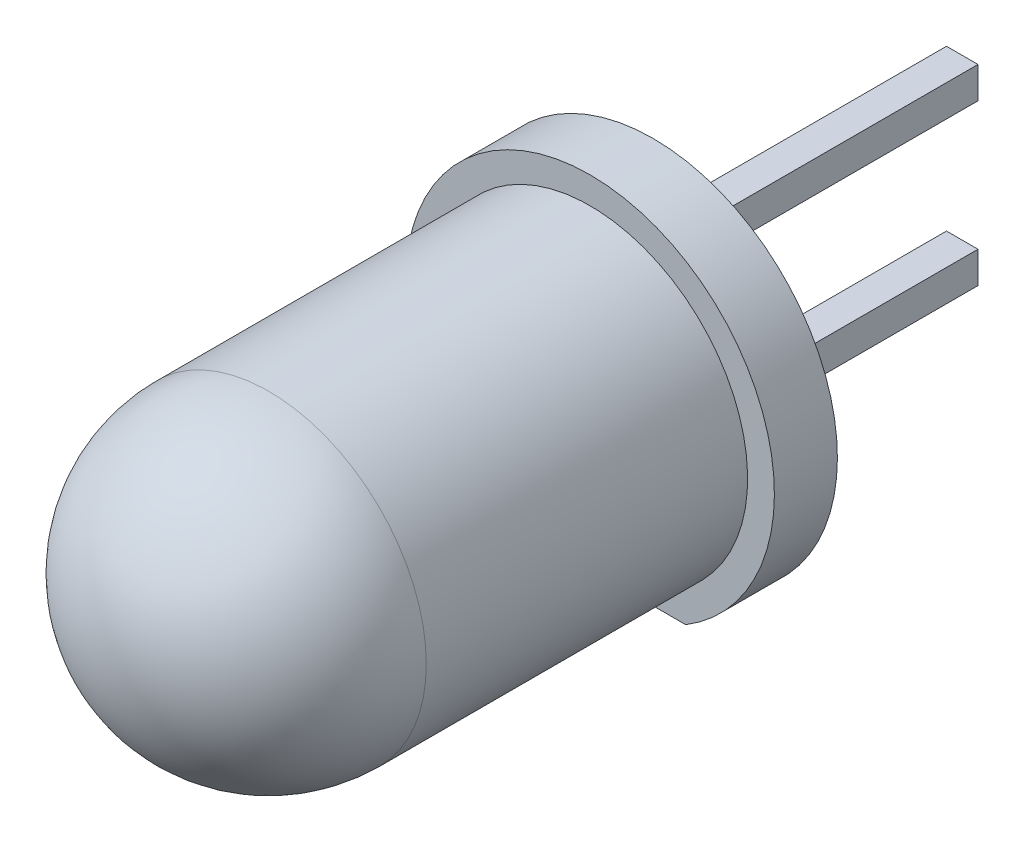
ISO-10303-21;
HEADER;
FILE_DESCRIPTION(('STEP AP214'),'2;1');
FILE_NAME('part.step','',(''),(''),'','','');
FILE_SCHEMA(('AUTOMOTIVE_DESIGN { 1 0 10303 214 1 1 1 1 }'));
ENDSEC;
DATA;
#1=APPLICATION_CONTEXT('core data for automotive mechanical design processes');
#2=APPLICATION_PROTOCOL_DEFINITION('international standard','automotive_design',2000,#1);
#3=PRODUCT_CONTEXT('',#1,'mechanical');
#4=PRODUCT('Part','Part','',(#3));
#5=PRODUCT_RELATED_PRODUCT_CATEGORY('part','',(#4));
#6=PRODUCT_DEFINITION_FORMATION('','',#4);
#7=PRODUCT_DEFINITION_CONTEXT('part definition',#1,'design');
#8=PRODUCT_DEFINITION('design','',#6,#7);
#9=PRODUCT_DEFINITION_SHAPE('','',#8);
#10=(LENGTH_UNIT() NAMED_UNIT(*) SI_UNIT(.MILLI.,.METRE.));
#11=(NAMED_UNIT(*) PLANE_ANGLE_UNIT() SI_UNIT($,.RADIAN.));
#12=(NAMED_UNIT(*) SI_UNIT($,.STERADIAN.) SOLID_ANGLE_UNIT());
#13=UNCERTAINTY_MEASURE_WITH_UNIT(LENGTH_MEASURE(1.E-05),#10,'distance_accuracy_value','');
#14=(GEOMETRIC_REPRESENTATION_CONTEXT(3) GLOBAL_UNCERTAINTY_ASSIGNED_CONTEXT((#13)) GLOBAL_UNIT_ASSIGNED_CONTEXT((#10,
#11,#12)) REPRESENTATION_CONTEXT('',''));
#15=CARTESIAN_POINT('',(0.,0.,0.));
#16=DIRECTION('',(0.,0.,1.));
#17=DIRECTION('',(1.,0.,0.));
#18=AXIS2_PLACEMENT_3D('',#15,#16,#17);
#19=CARTESIAN_POINT('',(0.,0.,-1.));
#20=DIRECTION('',(0.,0.,-1.));
#21=DIRECTION('',(-1.,0.,0.));
#22=AXIS2_PLACEMENT_3D('',#19,#20,#21);
#23=PLANE('',#22);
#24=DIRECTION('',(1.,0.,0.));
#25=VECTOR('',#24,1.);
#26=CARTESIAN_POINT('',(0.,-2.5,-1.));
#27=LINE('',#26,#25);
#28=CARTESIAN_POINT('',(-1.51842846390602,-2.5,-1.));
#29=VERTEX_POINT('',#28);
#30=CARTESIAN_POINT('',(1.51842846390602,-2.5,-1.));
#31=VERTEX_POINT('',#30);
#32=EDGE_CURVE('E215',#29,#31,#27,.T.);
#33=ORIENTED_EDGE('',*,*,#32,.F.);
#34=CARTESIAN_POINT('',(0.,0.,-1.));
#35=DIRECTION('',(0.,0.,-1.));
#36=DIRECTION('',(-1.,0.,0.));
#37=AXIS2_PLACEMENT_3D('',#34,#35,#36);
#38=CIRCLE('',#37,2.925);
#39=EDGE_CURVE('E214',#29,#31,#38,.T.);
#40=ORIENTED_EDGE('',*,*,#39,.T.);
#41=EDGE_LOOP('',(#33,#40));
#42=FACE_BOUND('',#41,.T.);
#43=DIRECTION('',(-1.,0.,0.));
#44=VECTOR('',#43,1.);
#45=CARTESIAN_POINT('',(-0.343693204923737,1.02,-1.));
#46=LINE('',#45,#44);
#47=CARTESIAN_POINT('',(0.156306795076263,1.02,-1.));
#48=VERTEX_POINT('',#47);
#49=CARTESIAN_POINT('',(-0.343693204923737,1.02,-1.));
#50=VERTEX_POINT('',#49);
#51=EDGE_CURVE('E757',#48,#50,#46,.T.);
#52=ORIENTED_EDGE('',*,*,#51,.F.);
#53=DIRECTION('',(0.,-1.,0.));
#54=VECTOR('',#53,1.);
#55=CARTESIAN_POINT('',(0.156306795076263,1.02,-1.));
#56=LINE('',#55,#54);
#57=CARTESIAN_POINT('',(0.156306795076263,1.52,-1.));
#58=VERTEX_POINT('',#57);
#59=EDGE_CURVE('E753',#58,#48,#56,.T.);
#60=ORIENTED_EDGE('',*,*,#59,.F.);
#61=DIRECTION('',(1.,0.,0.));
#62=VECTOR('',#61,1.);
#63=CARTESIAN_POINT('',(-0.343693204923737,1.52,-1.));
#64=LINE('',#63,#62);
#65=CARTESIAN_POINT('',(-0.343693204923737,1.52,-1.));
#66=VERTEX_POINT('',#65);
#67=EDGE_CURVE('E767',#66,#58,#64,.T.);
#68=ORIENTED_EDGE('',*,*,#67,.F.);
#69=DIRECTION('',(0.,1.,0.));
#70=VECTOR('',#69,1.);
#71=CARTESIAN_POINT('',(-0.343693204923737,1.02,-1.));
#72=LINE('',#71,#70);
#73=EDGE_CURVE('E775',#50,#66,#72,.T.);
#74=ORIENTED_EDGE('',*,*,#73,.F.);
#75=EDGE_LOOP('',(#52,#60,#68,#74));
#76=FACE_BOUND('',#75,.T.);
#77=DIRECTION('',(0.,-1.,0.));
#78=VECTOR('',#77,1.);
#79=CARTESIAN_POINT('',(0.156306795076263,-1.02,-1.));
#80=LINE('',#79,#78);
#81=CARTESIAN_POINT('',(0.156306795076263,-1.02,-1.));
#82=VERTEX_POINT('',#81);
#83=CARTESIAN_POINT('',(0.156306795076263,-1.52,-1.));
#84=VERTEX_POINT('',#83);
#85=EDGE_CURVE('E817',#82,#84,#80,.T.);
#86=ORIENTED_EDGE('',*,*,#85,.F.);
#87=DIRECTION('',(1.,0.,0.));
#88=VECTOR('',#87,1.);
#89=CARTESIAN_POINT('',(-0.343693204923737,-1.02,-1.));
#90=LINE('',#89,#88);
#91=CARTESIAN_POINT('',(-0.343693204923737,-1.02,-1.));
#92=VERTEX_POINT('',#91);
#93=EDGE_CURVE('E751',#92,#82,#90,.T.);
#94=ORIENTED_EDGE('',*,*,#93,.F.);
#95=DIRECTION('',(0.,1.,0.));
#96=VECTOR('',#95,1.);
#97=CARTESIAN_POINT('',(-0.343693204923737,-1.02,-1.));
#98=LINE('',#97,#96);
#99=CARTESIAN_POINT('',(-0.343693204923737,-1.52,-1.));
#100=VERTEX_POINT('',#99);
#101=EDGE_CURVE('E746',#100,#92,#98,.T.);
#102=ORIENTED_EDGE('',*,*,#101,.F.);
#103=DIRECTION('',(-1.,0.,0.));
#104=VECTOR('',#103,1.);
#105=CARTESIAN_POINT('',(-0.343693204923737,-1.52,-1.));
#106=LINE('',#105,#104);
#107=EDGE_CURVE('E819',#84,#100,#106,.T.);
#108=ORIENTED_EDGE('',*,*,#107,.F.);
#109=EDGE_LOOP('',(#86,#94,#102,#108));
#110=FACE_BOUND('',#109,.T.);
#111=ADVANCED_FACE('F37',(#42,#76,#110),#23,.T.);
#112=CARTESIAN_POINT('',(0.,0.,5.1));
#113=DIRECTION('',(0.,0.,-1.));
#114=DIRECTION('',(-1.,0.,0.));
#115=AXIS2_PLACEMENT_3D('',#112,#113,#114);
#116=CYLINDRICAL_SURFACE('',#115,2.5);
#117=CARTESIAN_POINT('',(0.,0.,5.1));
#118=DIRECTION('',(0.,0.,1.));
#119=DIRECTION('',(1.,0.,0.));
#120=AXIS2_PLACEMENT_3D('',#117,#118,#119);
#121=CIRCLE('',#120,2.5);
#122=CARTESIAN_POINT('',(2.5,0.,5.1));
#123=VERTEX_POINT('',#122);
#124=EDGE_CURVE('E46',#123,#123,#121,.T.);
#125=ORIENTED_EDGE('',*,*,#124,.F.);
#126=EDGE_LOOP('',(#125));
#127=FACE_BOUND('',#126,.T.);
#128=CARTESIAN_POINT('',(0.,0.,0.));
#129=DIRECTION('',(0.,0.,-1.));
#130=DIRECTION('',(-1.,0.,0.));
#131=AXIS2_PLACEMENT_3D('',#128,#129,#130);
#132=CIRCLE('',#131,2.5);
#133=CARTESIAN_POINT('',(0.,-2.5,0.));
#134=VERTEX_POINT('',#133);
#135=EDGE_CURVE('E220',#134,#134,#132,.T.);
#136=ORIENTED_EDGE('',*,*,#135,.F.);
#137=EDGE_LOOP('',(#136));
#138=FACE_BOUND('',#137,.T.);
#139=ADVANCED_FACE('F39',(#127,#138),#116,.T.);
#140=CARTESIAN_POINT('',(0.,0.,5.1));
#141=DIRECTION('',(-1.,0.,0.));
#142=DIRECTION('',(0.,-1.,0.));
#143=AXIS2_PLACEMENT_3D('',#140,#141,#142);
#144=SPHERICAL_SURFACE('',#143,2.5);
#145=CARTESIAN_POINT('',(0.,0.,5.1));
#146=DIRECTION('',(0.,0.,1.));
#147=DIRECTION('',(1.,0.,0.));
#148=AXIS2_PLACEMENT_3D('',#145,#146,#147);
#149=SPHERICAL_SURFACE('',#148,2.5);
#150=ORIENTED_EDGE('',*,*,#124,.T.);
#151=EDGE_LOOP('',(#150));
#152=FACE_BOUND('',#151,.T.);
#153=ADVANCED_FACE('F235',(#152),#149,.T.);
#154=CARTESIAN_POINT('',(0.,0.,-1.));
#155=DIRECTION('',(0.,0.,1.));
#156=DIRECTION('',(1.,0.,0.));
#157=AXIS2_PLACEMENT_3D('',#154,#155,#156);
#158=CYLINDRICAL_SURFACE('',#157,2.925);
#159=ORIENTED_EDGE('',*,*,#39,.F.);
#160=DIRECTION('',(0.,0.,1.));
#161=VECTOR('',#160,1.);
#162=CARTESIAN_POINT('',(-1.51842846390602,-2.5,-5.));
#163=LINE('',#162,#161);
#164=CARTESIAN_POINT('',(-1.51842846390602,-2.5,0.));
#165=VERTEX_POINT('',#164);
#166=EDGE_CURVE('E202',#29,#165,#163,.T.);
#167=ORIENTED_EDGE('',*,*,#166,.T.);
#168=CARTESIAN_POINT('',(0.,0.,0.));
#169=DIRECTION('',(0.,0.,-1.));
#170=DIRECTION('',(-1.,0.,0.));
#171=AXIS2_PLACEMENT_3D('',#168,#169,#170);
#172=CIRCLE('',#171,2.925);
#173=CARTESIAN_POINT('',(1.51842846390602,-2.5,0.));
#174=VERTEX_POINT('',#173);
#175=EDGE_CURVE('E212',#165,#174,#172,.T.);
#176=ORIENTED_EDGE('',*,*,#175,.T.);
#177=DIRECTION('',(0.,0.,1.));
#178=VECTOR('',#177,1.);
#179=CARTESIAN_POINT('',(1.51842846390602,-2.5,-5.));
#180=LINE('',#179,#178);
#181=EDGE_CURVE('E53',#31,#174,#180,.T.);
#182=ORIENTED_EDGE('',*,*,#181,.F.);
#183=EDGE_LOOP('',(#159,#167,#176,#182));
#184=FACE_BOUND('',#183,.T.);
#185=ADVANCED_FACE('F211',(#184),#158,.T.);
#186=CARTESIAN_POINT('',(0.,0.,0.));
#187=DIRECTION('',(0.,0.,-1.));
#188=DIRECTION('',(-1.,0.,0.));
#189=AXIS2_PLACEMENT_3D('',#186,#187,#188);
#190=PLANE('',#189);
#191=ORIENTED_EDGE('',*,*,#175,.F.);
#192=DIRECTION('',(1.,0.,0.));
#193=VECTOR('',#192,1.);
#194=CARTESIAN_POINT('',(0.,-2.5,0.));
#195=LINE('',#194,#193);
#196=EDGE_CURVE('E11',#165,#134,#195,.T.);
#197=ORIENTED_EDGE('',*,*,#196,.T.);
#198=ORIENTED_EDGE('',*,*,#135,.T.);
#199=DIRECTION('',(-1.,0.,0.));
#200=VECTOR('',#199,1.);
#201=CARTESIAN_POINT('',(1.51842846390602,-2.5,0.));
#202=LINE('',#201,#200);
#203=EDGE_CURVE('E204',#174,#134,#202,.T.);
#204=ORIENTED_EDGE('',*,*,#203,.F.);
#205=EDGE_LOOP('',(#191,#197,#198,#204));
#206=FACE_BOUND('',#205,.T.);
#207=ADVANCED_FACE('F217',(#206),#190,.F.);
#208=CARTESIAN_POINT('',(0.156306795076263,1.02,-6.));
#209=DIRECTION('',(-1.,0.,0.));
#210=DIRECTION('',(0.,0.,1.));
#211=AXIS2_PLACEMENT_3D('',#208,#209,#210);
#212=PLANE('',#211);
#213=ORIENTED_EDGE('',*,*,#59,.T.);
#214=DIRECTION('',(0.,0.,1.));
#215=VECTOR('',#214,1.);
#216=CARTESIAN_POINT('',(0.156306795076263,1.02,-6.));
#217=LINE('',#216,#215);
#218=CARTESIAN_POINT('',(0.156306795076263,1.02,-6.));
#219=VERTEX_POINT('',#218);
#220=EDGE_CURVE('E314',#219,#48,#217,.T.);
#221=ORIENTED_EDGE('',*,*,#220,.F.);
#222=DIRECTION('',(0.,-1.,0.));
#223=VECTOR('',#222,1.);
#224=CARTESIAN_POINT('',(0.156306795076263,1.02,-6.));
#225=LINE('',#224,#223);
#226=CARTESIAN_POINT('',(0.156306795076263,1.52,-6.));
#227=VERTEX_POINT('',#226);
#228=EDGE_CURVE('E763',#227,#219,#225,.T.);
#229=ORIENTED_EDGE('',*,*,#228,.F.);
#230=DIRECTION('',(0.,0.,1.));
#231=VECTOR('',#230,1.);
#232=CARTESIAN_POINT('',(0.156306795076263,1.52,-6.));
#233=LINE('',#232,#231);
#234=EDGE_CURVE('E772',#227,#58,#233,.T.);
#235=ORIENTED_EDGE('',*,*,#234,.T.);
#236=EDGE_LOOP('',(#213,#221,#229,#235));
#237=FACE_BOUND('',#236,.T.);
#238=ADVANCED_FACE('F256',(#237),#212,.F.);
#239=CARTESIAN_POINT('',(-0.343693204923737,1.02,-6.));
#240=DIRECTION('',(0.,1.,0.));
#241=DIRECTION('',(0.,0.,1.));
#242=AXIS2_PLACEMENT_3D('',#239,#240,#241);
#243=PLANE('',#242);
#244=ORIENTED_EDGE('',*,*,#51,.T.);
#245=DIRECTION('',(0.,0.,1.));
#246=VECTOR('',#245,1.);
#247=CARTESIAN_POINT('',(-0.343693204923737,1.02,-6.));
#248=LINE('',#247,#246);
#249=CARTESIAN_POINT('',(-0.343693204923737,1.02,-6.));
#250=VERTEX_POINT('',#249);
#251=EDGE_CURVE('E783',#250,#50,#248,.T.);
#252=ORIENTED_EDGE('',*,*,#251,.F.);
#253=DIRECTION('',(-1.,0.,0.));
#254=VECTOR('',#253,1.);
#255=CARTESIAN_POINT('',(-0.343693204923737,1.02,-6.));
#256=LINE('',#255,#254);
#257=EDGE_CURVE('E766',#219,#250,#256,.T.);
#258=ORIENTED_EDGE('',*,*,#257,.F.);
#259=ORIENTED_EDGE('',*,*,#220,.T.);
#260=EDGE_LOOP('',(#244,#252,#258,#259));
#261=FACE_BOUND('',#260,.T.);
#262=ADVANCED_FACE('F553',(#261),#243,.F.);
#263=CARTESIAN_POINT('',(-0.343693204923737,1.02,-6.));
#264=DIRECTION('',(1.,0.,0.));
#265=DIRECTION('',(0.,0.,-1.));
#266=AXIS2_PLACEMENT_3D('',#263,#264,#265);
#267=PLANE('',#266);
#268=ORIENTED_EDGE('',*,*,#73,.T.);
#269=DIRECTION('',(0.,0.,1.));
#270=VECTOR('',#269,1.);
#271=CARTESIAN_POINT('',(-0.343693204923737,1.52,-6.));
#272=LINE('',#271,#270);
#273=CARTESIAN_POINT('',(-0.343693204923737,1.52,-6.));
#274=VERTEX_POINT('',#273);
#275=EDGE_CURVE('E781',#274,#66,#272,.T.);
#276=ORIENTED_EDGE('',*,*,#275,.F.);
#277=DIRECTION('',(0.,1.,0.));
#278=VECTOR('',#277,1.);
#279=CARTESIAN_POINT('',(-0.343693204923737,1.02,-6.));
#280=LINE('',#279,#278);
#281=EDGE_CURVE('E769',#250,#274,#280,.T.);
#282=ORIENTED_EDGE('',*,*,#281,.F.);
#283=ORIENTED_EDGE('',*,*,#251,.T.);
#284=EDGE_LOOP('',(#268,#276,#282,#283));
#285=FACE_BOUND('',#284,.T.);
#286=ADVANCED_FACE('F566',(#285),#267,.F.);
#287=CARTESIAN_POINT('',(-0.343693204923737,1.52,-6.));
#288=DIRECTION('',(0.,-1.,0.));
#289=DIRECTION('',(0.,0.,-1.));
#290=AXIS2_PLACEMENT_3D('',#287,#288,#289);
#291=PLANE('',#290);
#292=ORIENTED_EDGE('',*,*,#67,.T.);
#293=ORIENTED_EDGE('',*,*,#234,.F.);
#294=DIRECTION('',(1.,0.,0.));
#295=VECTOR('',#294,1.);
#296=CARTESIAN_POINT('',(-0.343693204923737,1.52,-6.));
#297=LINE('',#296,#295);
#298=EDGE_CURVE('E771',#274,#227,#297,.T.);
#299=ORIENTED_EDGE('',*,*,#298,.F.);
#300=ORIENTED_EDGE('',*,*,#275,.T.);
#301=EDGE_LOOP('',(#292,#293,#299,#300));
#302=FACE_BOUND('',#301,.T.);
#303=ADVANCED_FACE('F579',(#302),#291,.F.);
#304=CARTESIAN_POINT('',(0.,0.,-6.));
#305=DIRECTION('',(0.,0.,-1.));
#306=DIRECTION('',(-1.,0.,0.));
#307=AXIS2_PLACEMENT_3D('',#304,#305,#306);
#308=PLANE('',#307);
#309=ORIENTED_EDGE('',*,*,#228,.T.);
#310=ORIENTED_EDGE('',*,*,#257,.T.);
#311=ORIENTED_EDGE('',*,*,#281,.T.);
#312=ORIENTED_EDGE('',*,*,#298,.T.);
#313=EDGE_LOOP('',(#309,#310,#311,#312));
#314=FACE_BOUND('',#313,.T.);
#315=ADVANCED_FACE('F590',(#314),#308,.T.);
#316=CARTESIAN_POINT('',(-0.343693204923737,-1.02,-6.));
#317=DIRECTION('',(0.,-1.,0.));
#318=DIRECTION('',(0.,0.,-1.));
#319=AXIS2_PLACEMENT_3D('',#316,#317,#318);
#320=PLANE('',#319);
#321=ORIENTED_EDGE('',*,*,#93,.T.);
#322=DIRECTION('',(0.,0.,1.));
#323=VECTOR('',#322,1.);
#324=CARTESIAN_POINT('',(0.156306795076263,-1.02,-6.));
#325=LINE('',#324,#323);
#326=CARTESIAN_POINT('',(0.156306795076263,-1.02,-6.));
#327=VERTEX_POINT('',#326);
#328=EDGE_CURVE('E749',#327,#82,#325,.T.);
#329=ORIENTED_EDGE('',*,*,#328,.F.);
#330=DIRECTION('',(1.,0.,0.));
#331=VECTOR('',#330,1.);
#332=CARTESIAN_POINT('',(-0.343693204923737,-1.02,-6.));
#333=LINE('',#332,#331);
#334=CARTESIAN_POINT('',(-0.343693204923737,-1.02,-6.));
#335=VERTEX_POINT('',#334);
#336=EDGE_CURVE('E739',#335,#327,#333,.T.);
#337=ORIENTED_EDGE('',*,*,#336,.F.);
#338=DIRECTION('',(0.,0.,1.));
#339=VECTOR('',#338,1.);
#340=CARTESIAN_POINT('',(-0.343693204923737,-1.02,-6.));
#341=LINE('',#340,#339);
#342=EDGE_CURVE('E826',#335,#92,#341,.T.);
#343=ORIENTED_EDGE('',*,*,#342,.T.);
#344=EDGE_LOOP('',(#321,#329,#337,#343));
#345=FACE_BOUND('',#344,.T.);
#346=ADVANCED_FACE('F602',(#345),#320,.F.);
#347=CARTESIAN_POINT('',(0.156306795076263,-1.02,-6.));
#348=DIRECTION('',(-1.,0.,0.));
#349=DIRECTION('',(0.,0.,1.));
#350=AXIS2_PLACEMENT_3D('',#347,#348,#349);
#351=PLANE('',#350);
#352=ORIENTED_EDGE('',*,*,#85,.T.);
#353=DIRECTION('',(0.,0.,1.));
#354=VECTOR('',#353,1.);
#355=CARTESIAN_POINT('',(0.156306795076263,-1.52,-6.));
#356=LINE('',#355,#354);
#357=CARTESIAN_POINT('',(0.156306795076263,-1.52,-6.));
#358=VERTEX_POINT('',#357);
#359=EDGE_CURVE('E754',#358,#84,#356,.T.);
#360=ORIENTED_EDGE('',*,*,#359,.F.);
#361=DIRECTION('',(0.,-1.,0.));
#362=VECTOR('',#361,1.);
#363=CARTESIAN_POINT('',(0.156306795076263,-1.02,-6.));
#364=LINE('',#363,#362);
#365=EDGE_CURVE('E741',#327,#358,#364,.T.);
#366=ORIENTED_EDGE('',*,*,#365,.F.);
#367=ORIENTED_EDGE('',*,*,#328,.T.);
#368=EDGE_LOOP('',(#352,#360,#366,#367));
#369=FACE_BOUND('',#368,.T.);
#370=ADVANCED_FACE('F613',(#369),#351,.F.);
#371=CARTESIAN_POINT('',(-0.343693204923737,-1.52,-6.));
#372=DIRECTION('',(0.,1.,0.));
#373=DIRECTION('',(0.,0.,1.));
#374=AXIS2_PLACEMENT_3D('',#371,#372,#373);
#375=PLANE('',#374);
#376=ORIENTED_EDGE('',*,*,#107,.T.);
#377=DIRECTION('',(0.,0.,1.));
#378=VECTOR('',#377,1.);
#379=CARTESIAN_POINT('',(-0.343693204923737,-1.52,-6.));
#380=LINE('',#379,#378);
#381=CARTESIAN_POINT('',(-0.343693204923737,-1.52,-6.));
#382=VERTEX_POINT('',#381);
#383=EDGE_CURVE('E61',#382,#100,#380,.T.);
#384=ORIENTED_EDGE('',*,*,#383,.F.);
#385=DIRECTION('',(-1.,0.,0.));
#386=VECTOR('',#385,1.);
#387=CARTESIAN_POINT('',(-0.343693204923737,-1.52,-6.));
#388=LINE('',#387,#386);
#389=EDGE_CURVE('E827',#358,#382,#388,.T.);
#390=ORIENTED_EDGE('',*,*,#389,.F.);
#391=ORIENTED_EDGE('',*,*,#359,.T.);
#392=EDGE_LOOP('',(#376,#384,#390,#391));
#393=FACE_BOUND('',#392,.T.);
#394=ADVANCED_FACE('F623',(#393),#375,.F.);
#395=CARTESIAN_POINT('',(-0.343693204923737,-1.02,-6.));
#396=DIRECTION('',(1.,0.,0.));
#397=DIRECTION('',(0.,0.,-1.));
#398=AXIS2_PLACEMENT_3D('',#395,#396,#397);
#399=PLANE('',#398);
#400=ORIENTED_EDGE('',*,*,#101,.T.);
#401=ORIENTED_EDGE('',*,*,#342,.F.);
#402=DIRECTION('',(0.,1.,0.));
#403=VECTOR('',#402,1.);
#404=CARTESIAN_POINT('',(-0.343693204923737,-1.02,-6.));
#405=LINE('',#404,#403);
#406=EDGE_CURVE('E743',#382,#335,#405,.T.);
#407=ORIENTED_EDGE('',*,*,#406,.F.);
#408=ORIENTED_EDGE('',*,*,#383,.T.);
#409=EDGE_LOOP('',(#400,#401,#407,#408));
#410=FACE_BOUND('',#409,.T.);
#411=ADVANCED_FACE('F634',(#410),#399,.F.);
#412=CARTESIAN_POINT('',(0.,0.,-6.));
#413=DIRECTION('',(0.,0.,-1.));
#414=DIRECTION('',(-1.,0.,0.));
#415=AXIS2_PLACEMENT_3D('',#412,#413,#414);
#416=PLANE('',#415);
#417=ORIENTED_EDGE('',*,*,#336,.T.);
#418=ORIENTED_EDGE('',*,*,#365,.T.);
#419=ORIENTED_EDGE('',*,*,#389,.T.);
#420=ORIENTED_EDGE('',*,*,#406,.T.);
#421=EDGE_LOOP('',(#417,#418,#419,#420));
#422=FACE_BOUND('',#421,.T.);
#423=ADVANCED_FACE('F644',(#422),#416,.T.);
#424=CARTESIAN_POINT('',(1.51842846390602,-2.5,-5.));
#425=DIRECTION('',(0.,1.,0.));
#426=DIRECTION('',(0.,0.,1.));
#427=AXIS2_PLACEMENT_3D('',#424,#425,#426);
#428=PLANE('',#427);
#429=ORIENTED_EDGE('',*,*,#32,.T.);
#430=ORIENTED_EDGE('',*,*,#181,.T.);
#431=ORIENTED_EDGE('',*,*,#203,.T.);
#432=ORIENTED_EDGE('',*,*,#196,.F.);
#433=ORIENTED_EDGE('',*,*,#166,.F.);
#434=EDGE_LOOP('',(#429,#430,#431,#432,#433));
#435=FACE_BOUND('',#434,.T.);
#436=ADVANCED_FACE('F201',(#435),#428,.F.);
#437=CLOSED_SHELL('',(#111,#139,#153,#185,#207,#238,#262,#286,#303,#315,#346,#370,#394,#411,
#423,#436));
#438=CARTESIAN_POINT('',(0.,0.,0.));
#439=DIRECTION('',(0.,0.,1.));
#440=DIRECTION('',(1.,0.,0.));
#441=AXIS2_PLACEMENT_3D('',#438,#439,#440);
#442=CIRCLE('',#441,2.);
#443=CARTESIAN_POINT('',(2.,0.,0.));
#444=VERTEX_POINT('',#443);
#445=EDGE_CURVE('E230',#444,#444,#442,.T.);
#446=ORIENTED_EDGE('',*,*,#445,.T.);
#447=EDGE_LOOP('',(#446));
#448=FACE_BOUND('',#447,.T.);
#449=DIRECTION('',(-1.,0.,0.));
#450=VECTOR('',#449,1.);
#451=CARTESIAN_POINT('',(0.25,1.07270159090425,0.));
#452=LINE('',#451,#450);
#453=CARTESIAN_POINT('',(0.25,1.07270159090425,0.));
#454=VERTEX_POINT('',#453);
#455=CARTESIAN_POINT('',(-0.25,1.07270159090425,0.));
#456=VERTEX_POINT('',#455);
#457=EDGE_CURVE('E218',#454,#456,#452,.T.);
#458=ORIENTED_EDGE('',*,*,#457,.F.);
#459=DIRECTION('',(0.,1.,0.));
#460=VECTOR('',#459,1.);
#461=CARTESIAN_POINT('',(0.25,1.07270159090425,0.));
#462=LINE('',#461,#460);
#463=CARTESIAN_POINT('',(0.25,0.763620954542548,0.));
#464=VERTEX_POINT('',#463);
#465=EDGE_CURVE('E348',#464,#454,#462,.T.);
#466=ORIENTED_EDGE('',*,*,#465,.F.);
#467=DIRECTION('',(-1.,0.,0.));
#468=VECTOR('',#467,1.);
#469=CARTESIAN_POINT('',(0.25,0.763620954542548,0.));
#470=LINE('',#469,#468);
#471=CARTESIAN_POINT('',(-0.25,0.763620954542548,0.));
#472=VERTEX_POINT('',#471);
#473=EDGE_CURVE('E363',#464,#472,#470,.T.);
#474=ORIENTED_EDGE('',*,*,#473,.T.);
#475=DIRECTION('',(0.,1.,0.));
#476=VECTOR('',#475,1.);
#477=CARTESIAN_POINT('',(-0.25,1.07270159090425,0.));
#478=LINE('',#477,#476);
#479=EDGE_CURVE('E347',#472,#456,#478,.T.);
#480=ORIENTED_EDGE('',*,*,#479,.T.);
#481=EDGE_LOOP('',(#458,#466,#474,#480));
#482=FACE_BOUND('',#481,.T.);
#483=DIRECTION('',(0.,1.,0.));
#484=VECTOR('',#483,1.);
#485=CARTESIAN_POINT('',(0.25,-0.417508620125371,0.));
#486=LINE('',#485,#484);
#487=CARTESIAN_POINT('',(0.25,-0.914245357135243,0.));
#488=VERTEX_POINT('',#487);
#489=CARTESIAN_POINT('',(0.25,-0.417508620125371,0.));
#490=VERTEX_POINT('',#489);
#491=EDGE_CURVE('E285',#488,#490,#486,.T.);
#492=ORIENTED_EDGE('',*,*,#491,.F.);
#493=DIRECTION('',(-1.,0.,0.));
#494=VECTOR('',#493,1.);
#495=CARTESIAN_POINT('',(0.25,-0.914245357135243,0.));
#496=LINE('',#495,#494);
#497=CARTESIAN_POINT('',(-0.25,-0.914245357135243,0.));
#498=VERTEX_POINT('',#497);
#499=EDGE_CURVE('E288',#488,#498,#496,.T.);
#500=ORIENTED_EDGE('',*,*,#499,.T.);
#501=DIRECTION('',(0.,1.,0.));
#502=VECTOR('',#501,1.);
#503=CARTESIAN_POINT('',(-0.25,-0.417508620125371,0.));
#504=LINE('',#503,#502);
#505=CARTESIAN_POINT('',(-0.25,-0.417508620125371,0.));
#506=VERTEX_POINT('',#505);
#507=EDGE_CURVE('E316',#498,#506,#504,.T.);
#508=ORIENTED_EDGE('',*,*,#507,.T.);
#509=DIRECTION('',(-1.,0.,0.));
#510=VECTOR('',#509,1.);
#511=CARTESIAN_POINT('',(0.25,-0.417508620125371,0.));
#512=LINE('',#511,#510);
#513=EDGE_CURVE('E290',#490,#506,#512,.T.);
#514=ORIENTED_EDGE('',*,*,#513,.F.);
#515=EDGE_LOOP('',(#492,#500,#508,#514));
#516=FACE_BOUND('',#515,.T.);
#517=ADVANCED_FACE('F257',(#448,#482,#516),#190,.F.);
#518=CARTESIAN_POINT('',(0.,0.,5.1));
#519=DIRECTION('',(-1.,0.,0.));
#520=DIRECTION('',(0.,1.,0.));
#521=AXIS2_PLACEMENT_3D('',#518,#519,#520);
#522=SPHERICAL_SURFACE('',#521,2.);
#523=CARTESIAN_POINT('',(0.,0.,5.1));
#524=DIRECTION('',(0.,0.,1.));
#525=DIRECTION('',(-1.,0.,0.));
#526=AXIS2_PLACEMENT_3D('',#523,#524,#525);
#527=SPHERICAL_SURFACE('',#526,2.);
#528=CARTESIAN_POINT('',(0.,0.,5.1));
#529=DIRECTION('',(0.,0.,1.));
#530=DIRECTION('',(-1.,0.,0.));
#531=AXIS2_PLACEMENT_3D('',#528,#529,#530);
#532=CIRCLE('',#531,2.);
#533=CARTESIAN_POINT('',(-2.,0.,5.1));
#534=VERTEX_POINT('',#533);
#535=EDGE_CURVE('E227',#534,#534,#532,.T.);
#536=ORIENTED_EDGE('',*,*,#535,.F.);
#537=EDGE_LOOP('',(#536));
#538=FACE_BOUND('',#537,.T.);
#539=ADVANCED_FACE('F260',(#538),#527,.F.);
#540=CARTESIAN_POINT('',(0.,0.,5.1));
#541=DIRECTION('',(0.,0.,-1.));
#542=DIRECTION('',(-1.,0.,0.));
#543=AXIS2_PLACEMENT_3D('',#540,#541,#542);
#544=CYLINDRICAL_SURFACE('',#543,2.);
#545=ORIENTED_EDGE('',*,*,#535,.T.);
#546=EDGE_LOOP('',(#545));
#547=FACE_BOUND('',#546,.T.);
#548=ORIENTED_EDGE('',*,*,#445,.F.);
#549=EDGE_LOOP('',(#548));
#550=FACE_BOUND('',#549,.T.);
#551=ADVANCED_FACE('F262',(#547,#550),#544,.F.);
#552=CARTESIAN_POINT('',(0.25,1.07270159090425,0.));
#553=DIRECTION('',(0.,-1.,0.));
#554=DIRECTION('',(0.,0.,-1.));
#555=AXIS2_PLACEMENT_3D('',#552,#553,#554);
#556=PLANE('',#555);
#557=DIRECTION('',(0.,0.,1.));
#558=VECTOR('',#557,1.);
#559=CARTESIAN_POINT('',(-0.25,1.07270159090425,0.));
#560=LINE('',#559,#558);
#561=CARTESIAN_POINT('',(-0.25,1.07270159090425,3.55616629422526));
#562=VERTEX_POINT('',#561);
#563=EDGE_CURVE('E365',#456,#562,#560,.T.);
#564=ORIENTED_EDGE('',*,*,#563,.T.);
#565=DIRECTION('',(-1.,0.,0.));
#566=VECTOR('',#565,1.);
#567=CARTESIAN_POINT('',(0.25,1.07270159090425,3.55616629422526));
#568=LINE('',#567,#566);
#569=CARTESIAN_POINT('',(0.25,1.07270159090425,3.55616629422526));
#570=VERTEX_POINT('',#569);
#571=EDGE_CURVE('E223',#570,#562,#568,.T.);
#572=ORIENTED_EDGE('',*,*,#571,.F.);
#573=DIRECTION('',(0.,0.,1.));
#574=VECTOR('',#573,1.);
#575=CARTESIAN_POINT('',(0.25,1.07270159090425,0.));
#576=LINE('',#575,#574);
#577=EDGE_CURVE('E351',#454,#570,#576,.T.);
#578=ORIENTED_EDGE('',*,*,#577,.F.);
#579=ORIENTED_EDGE('',*,*,#457,.T.);
#580=EDGE_LOOP('',(#564,#572,#578,#579));
#581=FACE_BOUND('',#580,.T.);
#582=ADVANCED_FACE('F252',(#581),#556,.F.);
#583=CARTESIAN_POINT('',(0.25,1.07270159090425,3.55616629422526));
#584=DIRECTION('',(0.,0.,-1.));
#585=DIRECTION('',(0.,1.,0.));
#586=AXIS2_PLACEMENT_3D('',#583,#584,#585);
#587=PLANE('',#586);
#588=DIRECTION('',(0.,-1.,0.));
#589=VECTOR('',#588,1.);
#590=CARTESIAN_POINT('',(-0.25,1.07270159090425,3.55616629422526));
#591=LINE('',#590,#589);
#592=CARTESIAN_POINT('',(-0.25,-0.218813925321421,3.55616629422526));
#593=VERTEX_POINT('',#592);
#594=EDGE_CURVE('E367',#562,#593,#591,.T.);
#595=ORIENTED_EDGE('',*,*,#594,.T.);
#596=DIRECTION('',(-1.,0.,0.));
#597=VECTOR('',#596,1.);
#598=CARTESIAN_POINT('',(0.25,-0.218813925321421,3.55616629422526));
#599=LINE('',#598,#597);
#600=CARTESIAN_POINT('',(0.25,-0.218813925321421,3.55616629422526));
#601=VERTEX_POINT('',#600);
#602=EDGE_CURVE('E382',#601,#593,#599,.T.);
#603=ORIENTED_EDGE('',*,*,#602,.F.);
#604=DIRECTION('',(0.,-1.,0.));
#605=VECTOR('',#604,1.);
#606=CARTESIAN_POINT('',(0.25,1.07270159090425,3.55616629422526));
#607=LINE('',#606,#605);
#608=EDGE_CURVE('E354',#570,#601,#607,.T.);
#609=ORIENTED_EDGE('',*,*,#608,.F.);
#610=ORIENTED_EDGE('',*,*,#571,.T.);
#611=EDGE_LOOP('',(#595,#603,#609,#610));
#612=FACE_BOUND('',#611,.T.);
#613=ADVANCED_FACE('F270',(#612),#587,.F.);
#614=CARTESIAN_POINT('',(0.25,-0.218813925321421,3.55616629422526));
#615=DIRECTION('',(0.,0.851111635158058,0.524984746919924));
#616=DIRECTION('',(0.,-0.524984746919924,0.851111635158058));
#617=AXIS2_PLACEMENT_3D('',#614,#615,#616);
#618=PLANE('',#617);
#619=DIRECTION('',(0.,0.524984746919924,-0.851111635158058));
#620=VECTOR('',#619,1.);
#621=CARTESIAN_POINT('',(-0.25,-0.218813925321421,3.55616629422526));
#622=LINE('',#621,#620);
#623=CARTESIAN_POINT('',(-0.25,0.509733288959725,2.37503671955734));
#624=VERTEX_POINT('',#623);
#625=EDGE_CURVE('E369',#593,#624,#622,.T.);
#626=ORIENTED_EDGE('',*,*,#625,.T.);
#627=DIRECTION('',(-1.,0.,0.));
#628=VECTOR('',#627,1.);
#629=CARTESIAN_POINT('',(0.25,0.509733288959725,2.37503671955734));
#630=LINE('',#629,#628);
#631=CARTESIAN_POINT('',(0.25,0.509733288959725,2.37503671955734));
#632=VERTEX_POINT('',#631);
#633=EDGE_CURVE('E379',#632,#624,#630,.T.);
#634=ORIENTED_EDGE('',*,*,#633,.F.);
#635=DIRECTION('',(0.,0.524984746919924,-0.851111635158058));
#636=VECTOR('',#635,1.);
#637=CARTESIAN_POINT('',(0.25,-0.218813925321421,3.55616629422526));
#638=LINE('',#637,#636);
#639=EDGE_CURVE('E356',#601,#632,#638,.T.);
#640=ORIENTED_EDGE('',*,*,#639,.F.);
#641=ORIENTED_EDGE('',*,*,#602,.T.);
#642=EDGE_LOOP('',(#626,#634,#640,#641));
#643=FACE_BOUND('',#642,.T.);
#644=ADVANCED_FACE('F400',(#643),#618,.F.);
#645=CARTESIAN_POINT('',(0.25,0.509733288959725,2.37503671955734));
#646=DIRECTION('',(0.,0.,1.));
#647=DIRECTION('',(0.,-1.,0.));
#648=AXIS2_PLACEMENT_3D('',#645,#646,#647);
#649=PLANE('',#648);
#650=DIRECTION('',(0.,1.,0.));
#651=VECTOR('',#650,1.);
#652=CARTESIAN_POINT('',(-0.25,0.509733288959725,2.37503671955734));
#653=LINE('',#652,#651);
#654=CARTESIAN_POINT('',(-0.25,0.763620954542548,2.37503671955734));
#655=VERTEX_POINT('',#654);
#656=EDGE_CURVE('E371',#624,#655,#653,.T.);
#657=ORIENTED_EDGE('',*,*,#656,.T.);
#658=DIRECTION('',(-1.,0.,0.));
#659=VECTOR('',#658,1.);
#660=CARTESIAN_POINT('',(0.25,0.763620954542548,2.37503671955734));
#661=LINE('',#660,#659);
#662=CARTESIAN_POINT('',(0.25,0.763620954542548,2.37503671955734));
#663=VERTEX_POINT('',#662);
#664=EDGE_CURVE('E376',#663,#655,#661,.T.);
#665=ORIENTED_EDGE('',*,*,#664,.F.);
#666=DIRECTION('',(0.,1.,0.));
#667=VECTOR('',#666,1.);
#668=CARTESIAN_POINT('',(0.25,0.509733288959725,2.37503671955734));
#669=LINE('',#668,#667);
#670=EDGE_CURVE('E358',#632,#663,#669,.T.);
#671=ORIENTED_EDGE('',*,*,#670,.F.);
#672=ORIENTED_EDGE('',*,*,#633,.T.);
#673=EDGE_LOOP('',(#657,#665,#671,#672));
#674=FACE_BOUND('',#673,.T.);
#675=ADVANCED_FACE('F404',(#674),#649,.F.);
#676=CARTESIAN_POINT('',(0.25,0.763620954542548,2.37503671955734));
#677=DIRECTION('',(0.,1.,0.));
#678=DIRECTION('',(0.,0.,1.));
#679=AXIS2_PLACEMENT_3D('',#676,#677,#678);
#680=PLANE('',#679);
#681=DIRECTION('',(0.,0.,-1.));
#682=VECTOR('',#681,1.);
#683=CARTESIAN_POINT('',(-0.25,0.763620954542548,2.37503671955734));
#684=LINE('',#683,#682);
#685=EDGE_CURVE('E352',#655,#472,#684,.T.);
#686=ORIENTED_EDGE('',*,*,#685,.T.);
#687=ORIENTED_EDGE('',*,*,#473,.F.);
#688=DIRECTION('',(0.,0.,-1.));
#689=VECTOR('',#688,1.);
#690=CARTESIAN_POINT('',(0.25,0.763620954542548,2.37503671955734));
#691=LINE('',#690,#689);
#692=EDGE_CURVE('E360',#663,#464,#691,.T.);
#693=ORIENTED_EDGE('',*,*,#692,.F.);
#694=ORIENTED_EDGE('',*,*,#664,.T.);
#695=EDGE_LOOP('',(#686,#687,#693,#694));
#696=FACE_BOUND('',#695,.T.);
#697=ADVANCED_FACE('F411',(#696),#680,.F.);
#698=CARTESIAN_POINT('',(0.25,0.,0.));
#699=DIRECTION('',(1.,0.,0.));
#700=DIRECTION('',(0.,0.,-1.));
#701=AXIS2_PLACEMENT_3D('',#698,#699,#700);
#702=PLANE('',#701);
#703=ORIENTED_EDGE('',*,*,#465,.T.);
#704=ORIENTED_EDGE('',*,*,#577,.T.);
#705=ORIENTED_EDGE('',*,*,#608,.T.);
#706=ORIENTED_EDGE('',*,*,#639,.T.);
#707=ORIENTED_EDGE('',*,*,#670,.T.);
#708=ORIENTED_EDGE('',*,*,#692,.T.);
#709=EDGE_LOOP('',(#703,#704,#705,#706,#707,#708));
#710=FACE_BOUND('',#709,.T.);
#711=ADVANCED_FACE('F408',(#710),#702,.T.);
#712=CARTESIAN_POINT('',(-0.25,0.,0.));
#713=DIRECTION('',(1.,0.,0.));
#714=DIRECTION('',(0.,0.,-1.));
#715=AXIS2_PLACEMENT_3D('',#712,#713,#714);
#716=PLANE('',#715);
#717=ORIENTED_EDGE('',*,*,#479,.F.);
#718=ORIENTED_EDGE('',*,*,#685,.F.);
#719=ORIENTED_EDGE('',*,*,#656,.F.);
#720=ORIENTED_EDGE('',*,*,#625,.F.);
#721=ORIENTED_EDGE('',*,*,#594,.F.);
#722=ORIENTED_EDGE('',*,*,#563,.F.);
#723=EDGE_LOOP('',(#717,#718,#719,#720,#721,#722));
#724=FACE_BOUND('',#723,.T.);
#725=ADVANCED_FACE('F395',(#724),#716,.F.);
#726=CARTESIAN_POINT('',(0.25,-0.914245357135243,3.55616629422526));
#727=DIRECTION('',(0.,0.,-1.));
#728=DIRECTION('',(-1.,0.,0.));
#729=AXIS2_PLACEMENT_3D('',#726,#727,#728);
#730=PLANE('',#729);
#731=DIRECTION('',(0.,-1.,0.));
#732=VECTOR('',#731,1.);
#733=CARTESIAN_POINT('',(-0.25,-0.914245357135243,3.55616629422526));
#734=LINE('',#733,#732);
#735=CARTESIAN_POINT('',(-0.25,-0.417508620125371,3.55616629422526));
#736=VERTEX_POINT('',#735);
#737=CARTESIAN_POINT('',(-0.25,-0.914245357135243,3.55616629422526));
#738=VERTEX_POINT('',#737);
#739=EDGE_CURVE('E310',#736,#738,#734,.T.);
#740=ORIENTED_EDGE('',*,*,#739,.T.);
#741=DIRECTION('',(-1.,0.,0.));
#742=VECTOR('',#741,1.);
#743=CARTESIAN_POINT('',(0.25,-0.914245357135243,3.55616629422526));
#744=LINE('',#743,#742);
#745=CARTESIAN_POINT('',(0.25,-0.914245357135243,3.55616629422526));
#746=VERTEX_POINT('',#745);
#747=EDGE_CURVE('E344',#746,#738,#744,.T.);
#748=ORIENTED_EDGE('',*,*,#747,.F.);
#749=DIRECTION('',(0.,-1.,0.));
#750=VECTOR('',#749,1.);
#751=CARTESIAN_POINT('',(0.25,-0.914245357135243,3.55616629422526));
#752=LINE('',#751,#750);
#753=CARTESIAN_POINT('',(0.25,-0.417508620125371,3.55616629422526));
#754=VERTEX_POINT('',#753);
#755=EDGE_CURVE('E298',#754,#746,#752,.T.);
#756=ORIENTED_EDGE('',*,*,#755,.F.);
#757=DIRECTION('',(-1.,0.,0.));
#758=VECTOR('',#757,1.);
#759=CARTESIAN_POINT('',(0.25,-0.417508620125371,3.55616629422526));
#760=LINE('',#759,#758);
#761=EDGE_CURVE('E309',#754,#736,#760,.T.);
#762=ORIENTED_EDGE('',*,*,#761,.T.);
#763=EDGE_LOOP('',(#740,#748,#756,#762));
#764=FACE_BOUND('',#763,.T.);
#765=ADVANCED_FACE('F455',(#764),#730,.F.);
#766=CARTESIAN_POINT('',(0.25,-0.914245357135243,0.));
#767=DIRECTION('',(0.,1.,0.));
#768=DIRECTION('',(0.,0.,1.));
#769=AXIS2_PLACEMENT_3D('',#766,#767,#768);
#770=PLANE('',#769);
#771=DIRECTION('',(0.,0.,-1.));
#772=VECTOR('',#771,1.);
#773=CARTESIAN_POINT('',(-0.25,-0.914245357135243,0.));
#774=LINE('',#773,#772);
#775=EDGE_CURVE('E313',#738,#498,#774,.T.);
#776=ORIENTED_EDGE('',*,*,#775,.T.);
#777=ORIENTED_EDGE('',*,*,#499,.F.);
#778=DIRECTION('',(0.,0.,-1.));
#779=VECTOR('',#778,1.);
#780=CARTESIAN_POINT('',(0.25,-0.914245357135243,0.));
#781=LINE('',#780,#779);
#782=EDGE_CURVE('E294',#746,#488,#781,.T.);
#783=ORIENTED_EDGE('',*,*,#782,.F.);
#784=ORIENTED_EDGE('',*,*,#747,.T.);
#785=EDGE_LOOP('',(#776,#777,#783,#784));
#786=FACE_BOUND('',#785,.T.);
#787=ADVANCED_FACE('F463',(#786),#770,.F.);
#788=CARTESIAN_POINT('',(0.25,-0.417508620125371,2.37503671955734));
#789=DIRECTION('',(0.,-1.,0.));
#790=DIRECTION('',(0.,0.,-1.));
#791=AXIS2_PLACEMENT_3D('',#788,#789,#790);
#792=PLANE('',#791);
#793=DIRECTION('',(0.,0.,1.));
#794=VECTOR('',#793,1.);
#795=CARTESIAN_POINT('',(-0.25,-0.417508620125371,2.37503671955734));
#796=LINE('',#795,#794);
#797=CARTESIAN_POINT('',(-0.25,-0.417508620125371,2.37503671955734));
#798=VERTEX_POINT('',#797);
#799=EDGE_CURVE('E318',#506,#798,#796,.T.);
#800=ORIENTED_EDGE('',*,*,#799,.T.);
#801=DIRECTION('',(-1.,0.,0.));
#802=VECTOR('',#801,1.);
#803=CARTESIAN_POINT('',(0.25,-0.417508620125371,2.37503671955734));
#804=LINE('',#803,#802);
#805=CARTESIAN_POINT('',(0.25,-0.417508620125371,2.37503671955734));
#806=VERTEX_POINT('',#805);
#807=EDGE_CURVE('E339',#806,#798,#804,.T.);
#808=ORIENTED_EDGE('',*,*,#807,.F.);
#809=DIRECTION('',(0.,0.,1.));
#810=VECTOR('',#809,1.);
#811=CARTESIAN_POINT('',(0.25,-0.417508620125371,2.37503671955734));
#812=LINE('',#811,#810);
#813=EDGE_CURVE('E293',#490,#806,#812,.T.);
#814=ORIENTED_EDGE('',*,*,#813,.F.);
#815=ORIENTED_EDGE('',*,*,#513,.T.);
#816=EDGE_LOOP('',(#800,#808,#814,#815));
#817=FACE_BOUND('',#816,.T.);
#818=ADVANCED_FACE('F473',(#817),#792,.F.);
#819=CARTESIAN_POINT('',(0.25,0.3,2.37503671955734));
#820=DIRECTION('',(0.,0.,1.));
#821=DIRECTION('',(1.,0.,0.));
#822=AXIS2_PLACEMENT_3D('',#819,#820,#821);
#823=PLANE('',#822);
#824=DIRECTION('',(0.,1.,0.));
#825=VECTOR('',#824,1.);
#826=CARTESIAN_POINT('',(-0.25,0.3,2.37503671955734));
#827=LINE('',#826,#825);
#828=CARTESIAN_POINT('',(-0.25,0.3,2.37503671955734));
#829=VERTEX_POINT('',#828);
#830=EDGE_CURVE('E320',#798,#829,#827,.T.);
#831=ORIENTED_EDGE('',*,*,#830,.T.);
#832=DIRECTION('',(-1.,0.,0.));
#833=VECTOR('',#832,1.);
#834=CARTESIAN_POINT('',(0.25,0.3,2.37503671955734));
#835=LINE('',#834,#833);
#836=CARTESIAN_POINT('',(0.25,0.3,2.37503671955734));
#837=VERTEX_POINT('',#836);
#838=EDGE_CURVE('E336',#837,#829,#835,.T.);
#839=ORIENTED_EDGE('',*,*,#838,.F.);
#840=DIRECTION('',(0.,1.,0.));
#841=VECTOR('',#840,1.);
#842=CARTESIAN_POINT('',(0.25,0.3,2.37503671955734));
#843=LINE('',#842,#841);
#844=EDGE_CURVE('E296',#806,#837,#843,.T.);
#845=ORIENTED_EDGE('',*,*,#844,.F.);
#846=ORIENTED_EDGE('',*,*,#807,.T.);
#847=EDGE_LOOP('',(#831,#839,#845,#846));
#848=FACE_BOUND('',#847,.T.);
#849=ADVANCED_FACE('F483',(#848),#823,.F.);
#850=CARTESIAN_POINT('',(0.25,0.3,2.37503671955734));
#851=DIRECTION('',(0.,-0.840973390710317,-0.541076478990902));
#852=DIRECTION('',(0.,0.541076478990902,-0.840973390710317));
#853=AXIS2_PLACEMENT_3D('',#850,#851,#852);
#854=PLANE('',#853);
#855=DIRECTION('',(0.,-0.541076478990902,0.840973390710317));
#856=VECTOR('',#855,1.);
#857=CARTESIAN_POINT('',(-0.25,0.3,2.37503671955734));
#858=LINE('',#857,#856);
#859=CARTESIAN_POINT('',(-0.25,-0.315038420075432,3.3309661780187));
#860=VERTEX_POINT('',#859);
#861=EDGE_CURVE('E322',#829,#860,#858,.T.);
#862=ORIENTED_EDGE('',*,*,#861,.T.);
#863=DIRECTION('',(-1.,0.,0.));
#864=VECTOR('',#863,1.);
#865=CARTESIAN_POINT('',(0.25,-0.315038420075432,3.3309661780187));
#866=LINE('',#865,#864);
#867=CARTESIAN_POINT('',(0.25,-0.315038420075432,3.3309661780187));
#868=VERTEX_POINT('',#867);
#869=EDGE_CURVE('E333',#868,#860,#866,.T.);
#870=ORIENTED_EDGE('',*,*,#869,.F.);
#871=DIRECTION('',(0.,-0.541076478990902,0.840973390710317));
#872=VECTOR('',#871,1.);
#873=CARTESIAN_POINT('',(0.25,0.3,2.37503671955734));
#874=LINE('',#873,#872);
#875=EDGE_CURVE('E303',#837,#868,#874,.T.);
#876=ORIENTED_EDGE('',*,*,#875,.F.);
#877=ORIENTED_EDGE('',*,*,#838,.T.);
#878=EDGE_LOOP('',(#862,#870,#876,#877));
#879=FACE_BOUND('',#878,.T.);
#880=ADVANCED_FACE('F493',(#879),#854,.F.);
#881=CARTESIAN_POINT('',(0.25,-0.315038420075432,3.3309661780187));
#882=DIRECTION('',(0.,0.,-1.));
#883=DIRECTION('',(-1.,0.,0.));
#884=AXIS2_PLACEMENT_3D('',#881,#882,#883);
#885=PLANE('',#884);
#886=DIRECTION('',(0.,-1.,0.));
#887=VECTOR('',#886,1.);
#888=CARTESIAN_POINT('',(-0.25,-0.315038420075432,3.3309661780187));
#889=LINE('',#888,#887);
#890=CARTESIAN_POINT('',(-0.25,-0.417508620125371,3.3309661780187));
#891=VERTEX_POINT('',#890);
#892=EDGE_CURVE('E324',#860,#891,#889,.T.);
#893=ORIENTED_EDGE('',*,*,#892,.T.);
#894=DIRECTION('',(-1.,0.,0.));
#895=VECTOR('',#894,1.);
#896=CARTESIAN_POINT('',(0.25,-0.417508620125371,3.3309661780187));
#897=LINE('',#896,#895);
#898=CARTESIAN_POINT('',(0.25,-0.417508620125371,3.3309661780187));
#899=VERTEX_POINT('',#898);
#900=EDGE_CURVE('E330',#899,#891,#897,.T.);
#901=ORIENTED_EDGE('',*,*,#900,.F.);
#902=DIRECTION('',(0.,-1.,0.));
#903=VECTOR('',#902,1.);
#904=CARTESIAN_POINT('',(0.25,-0.315038420075432,3.3309661780187));
#905=LINE('',#904,#903);
#906=EDGE_CURVE('E305',#868,#899,#905,.T.);
#907=ORIENTED_EDGE('',*,*,#906,.F.);
#908=ORIENTED_EDGE('',*,*,#869,.T.);
#909=EDGE_LOOP('',(#893,#901,#907,#908));
#910=FACE_BOUND('',#909,.T.);
#911=ADVANCED_FACE('F503',(#910),#885,.F.);
#912=CARTESIAN_POINT('',(0.25,-0.417508620125371,3.55616629422526));
#913=DIRECTION('',(0.,-1.,0.));
#914=DIRECTION('',(0.,0.,-1.));
#915=AXIS2_PLACEMENT_3D('',#912,#913,#914);
#916=PLANE('',#915);
#917=DIRECTION('',(0.,0.,1.));
#918=VECTOR('',#917,1.);
#919=CARTESIAN_POINT('',(-0.25,-0.417508620125371,3.55616629422526));
#920=LINE('',#919,#918);
#921=EDGE_CURVE('E326',#891,#736,#920,.T.);
#922=ORIENTED_EDGE('',*,*,#921,.T.);
#923=ORIENTED_EDGE('',*,*,#761,.F.);
#924=DIRECTION('',(0.,0.,1.));
#925=VECTOR('',#924,1.);
#926=CARTESIAN_POINT('',(0.25,-0.417508620125371,3.55616629422526));
#927=LINE('',#926,#925);
#928=EDGE_CURVE('E307',#899,#754,#927,.T.);
#929=ORIENTED_EDGE('',*,*,#928,.F.);
#930=ORIENTED_EDGE('',*,*,#900,.T.);
#931=EDGE_LOOP('',(#922,#923,#929,#930));
#932=FACE_BOUND('',#931,.T.);
#933=ADVANCED_FACE('F513',(#932),#916,.F.);
#934=CARTESIAN_POINT('',(0.25,0.,0.));
#935=DIRECTION('',(-1.,0.,0.));
#936=DIRECTION('',(0.,0.,1.));
#937=AXIS2_PLACEMENT_3D('',#934,#935,#936);
#938=PLANE('',#937);
#939=ORIENTED_EDGE('',*,*,#755,.T.);
#940=ORIENTED_EDGE('',*,*,#782,.T.);
#941=ORIENTED_EDGE('',*,*,#491,.T.);
#942=ORIENTED_EDGE('',*,*,#813,.T.);
#943=ORIENTED_EDGE('',*,*,#844,.T.);
#944=ORIENTED_EDGE('',*,*,#875,.T.);
#945=ORIENTED_EDGE('',*,*,#906,.T.);
#946=ORIENTED_EDGE('',*,*,#928,.T.);
#947=EDGE_LOOP('',(#939,#940,#941,#942,#943,#944,#945,#946));
#948=FACE_BOUND('',#947,.T.);
#949=ADVANCED_FACE('F523',(#948),#938,.F.);
#950=CARTESIAN_POINT('',(-0.25,0.,0.));
#951=DIRECTION('',(-1.,0.,0.));
#952=DIRECTION('',(0.,0.,1.));
#953=AXIS2_PLACEMENT_3D('',#950,#951,#952);
#954=PLANE('',#953);
#955=ORIENTED_EDGE('',*,*,#739,.F.);
#956=ORIENTED_EDGE('',*,*,#921,.F.);
#957=ORIENTED_EDGE('',*,*,#892,.F.);
#958=ORIENTED_EDGE('',*,*,#861,.F.);
#959=ORIENTED_EDGE('',*,*,#830,.F.);
#960=ORIENTED_EDGE('',*,*,#799,.F.);
#961=ORIENTED_EDGE('',*,*,#507,.F.);
#962=ORIENTED_EDGE('',*,*,#775,.F.);
#963=EDGE_LOOP('',(#955,#956,#957,#958,#959,#960,#961,#962));
#964=FACE_BOUND('',#963,.T.);
#965=ADVANCED_FACE('F533',(#964),#954,.T.);
#966=CLOSED_SHELL('',(#517,#539,#551,#582,#613,#644,#675,#697,#711,#725,#765,#787,#818,#849,
#880,#911,#933,#949,#965));
#967=ORIENTED_CLOSED_SHELL('',*,#966,.T.);
#968=BREP_WITH_VOIDS('B2',#437,(#967));
#969=ADVANCED_BREP_SHAPE_REPRESENTATION('',(#18,#968),#14);
#970=SHAPE_DEFINITION_REPRESENTATION(#9,#969);
ENDSEC;
END-ISO-10303-21;
